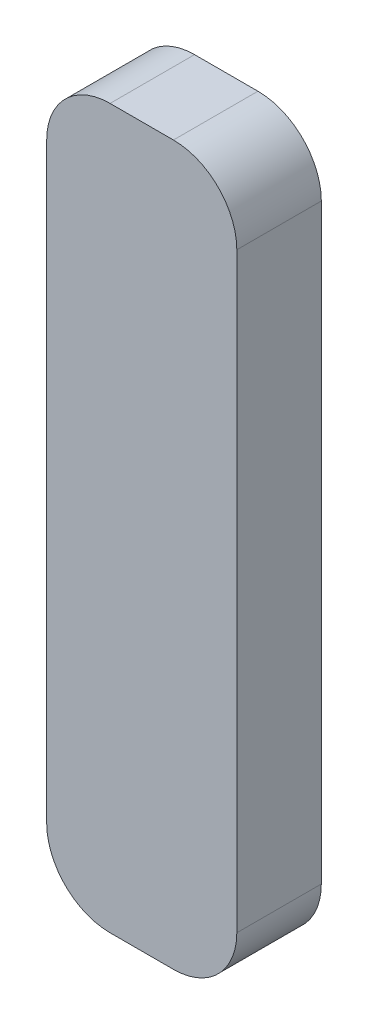
ISO-10303-21;
HEADER;
FILE_DESCRIPTION(('STEP AP214'),'2;1');
FILE_NAME('part.step','',(''),(''),'','','');
FILE_SCHEMA(('AUTOMOTIVE_DESIGN { 1 0 10303 214 1 1 1 1 }'));
ENDSEC;
DATA;
#1=APPLICATION_CONTEXT('core data for automotive mechanical design processes');
#2=APPLICATION_PROTOCOL_DEFINITION('international standard','automotive_design',2000,#1);
#3=PRODUCT_CONTEXT('',#1,'mechanical');
#4=PRODUCT('Part','Part','',(#3));
#5=PRODUCT_RELATED_PRODUCT_CATEGORY('part','',(#4));
#6=PRODUCT_DEFINITION_FORMATION('','',#4);
#7=PRODUCT_DEFINITION_CONTEXT('part definition',#1,'design');
#8=PRODUCT_DEFINITION('design','',#6,#7);
#9=PRODUCT_DEFINITION_SHAPE('','',#8);
#10=(LENGTH_UNIT() NAMED_UNIT(*) SI_UNIT(.MILLI.,.METRE.));
#11=(NAMED_UNIT(*) PLANE_ANGLE_UNIT() SI_UNIT($,.RADIAN.));
#12=(NAMED_UNIT(*) SI_UNIT($,.STERADIAN.) SOLID_ANGLE_UNIT());
#13=UNCERTAINTY_MEASURE_WITH_UNIT(LENGTH_MEASURE(1.E-05),#10,'distance_accuracy_value','');
#14=(GEOMETRIC_REPRESENTATION_CONTEXT(3) GLOBAL_UNCERTAINTY_ASSIGNED_CONTEXT((#13)) GLOBAL_UNIT_ASSIGNED_CONTEXT((#10,
#11,#12)) REPRESENTATION_CONTEXT('',''));
#15=CARTESIAN_POINT('',(0.,0.,0.));
#16=DIRECTION('',(0.,0.,1.));
#17=DIRECTION('',(1.,0.,0.));
#18=AXIS2_PLACEMENT_3D('',#15,#16,#17);
#19=CARTESIAN_POINT('',(-27.0655509183035,-46.2165040650407,4.));
#20=DIRECTION('',(1.,0.,0.));
#21=DIRECTION('',(0.,1.,0.));
#22=AXIS2_PLACEMENT_3D('',#19,#20,#21);
#23=PLANE('',#22);
#24=DIRECTION('',(0.,-1.,0.));
#25=VECTOR('',#24,1.);
#26=CARTESIAN_POINT('',(-27.0655509183035,-46.2165040650407,0.));
#27=LINE('',#26,#25);
#28=CARTESIAN_POINT('',(-27.0655509183035,-49.2165040650407,0.));
#29=VERTEX_POINT('',#28);
#30=CARTESIAN_POINT('',(-27.0655509183035,-77.2165040650407,0.));
#31=VERTEX_POINT('',#30);
#32=EDGE_CURVE('E125',#29,#31,#27,.T.);
#33=ORIENTED_EDGE('',*,*,#32,.T.);
#34=DIRECTION('',(0.,0.,-1.));
#35=VECTOR('',#34,1.);
#36=CARTESIAN_POINT('',(-27.0655509183035,-77.2165040650407,4.));
#37=LINE('',#36,#35);
#38=CARTESIAN_POINT('',(-27.0655509183035,-77.2165040650407,4.));
#39=VERTEX_POINT('',#38);
#40=EDGE_CURVE('E103',#31,#39,#37,.F.);
#41=ORIENTED_EDGE('',*,*,#40,.T.);
#42=DIRECTION('',(0.,-1.,0.));
#43=VECTOR('',#42,1.);
#44=CARTESIAN_POINT('',(-27.0655509183035,-46.2165040650407,4.));
#45=LINE('',#44,#43);
#46=CARTESIAN_POINT('',(-27.0655509183035,-49.2165040650407,4.));
#47=VERTEX_POINT('',#46);
#48=EDGE_CURVE('E134',#47,#39,#45,.T.);
#49=ORIENTED_EDGE('',*,*,#48,.F.);
#50=DIRECTION('',(0.,0.,-1.));
#51=VECTOR('',#50,1.);
#52=CARTESIAN_POINT('',(-27.0655509183035,-49.2165040650407,4.));
#53=LINE('',#52,#51);
#54=EDGE_CURVE('E108',#47,#29,#53,.T.);
#55=ORIENTED_EDGE('',*,*,#54,.T.);
#56=EDGE_LOOP('',(#33,#41,#49,#55));
#57=FACE_BOUND('',#56,.T.);
#58=ADVANCED_FACE('F33',(#57),#23,.F.);
#59=CARTESIAN_POINT('',(-27.0655509183035,-80.2165040650407,4.));
#60=DIRECTION('',(0.,1.,0.));
#61=DIRECTION('',(0.,0.,1.));
#62=AXIS2_PLACEMENT_3D('',#59,#60,#61);
#63=PLANE('',#62);
#64=DIRECTION('',(1.,0.,0.));
#65=VECTOR('',#64,1.);
#66=CARTESIAN_POINT('',(-27.0655509183035,-80.2165040650407,4.));
#67=LINE('',#66,#65);
#68=CARTESIAN_POINT('',(-24.0655509183035,-80.2165040650407,4.));
#69=VERTEX_POINT('',#68);
#70=CARTESIAN_POINT('',(-21.0655509183035,-80.2165040650407,4.));
#71=VERTEX_POINT('',#70);
#72=EDGE_CURVE('E118',#69,#71,#67,.T.);
#73=ORIENTED_EDGE('',*,*,#72,.F.);
#74=DIRECTION('',(0.,0.,-1.));
#75=VECTOR('',#74,1.);
#76=CARTESIAN_POINT('',(-24.0655509183035,-80.2165040650407,4.));
#77=LINE('',#76,#75);
#78=CARTESIAN_POINT('',(-24.0655509183035,-80.2165040650407,0.));
#79=VERTEX_POINT('',#78);
#80=EDGE_CURVE('E102',#69,#79,#77,.T.);
#81=ORIENTED_EDGE('',*,*,#80,.T.);
#82=DIRECTION('',(1.,0.,0.));
#83=VECTOR('',#82,1.);
#84=CARTESIAN_POINT('',(-27.0655509183035,-80.2165040650407,0.));
#85=LINE('',#84,#83);
#86=CARTESIAN_POINT('',(-21.0655509183035,-80.2165040650407,0.));
#87=VERTEX_POINT('',#86);
#88=EDGE_CURVE('E115',#79,#87,#85,.T.);
#89=ORIENTED_EDGE('',*,*,#88,.T.);
#90=DIRECTION('',(0.,0.,-1.));
#91=VECTOR('',#90,1.);
#92=CARTESIAN_POINT('',(-21.0655509183035,-80.2165040650407,4.));
#93=LINE('',#92,#91);
#94=EDGE_CURVE('E120',#87,#71,#93,.F.);
#95=ORIENTED_EDGE('',*,*,#94,.T.);
#96=EDGE_LOOP('',(#73,#81,#89,#95));
#97=FACE_BOUND('',#96,.T.);
#98=ADVANCED_FACE('F114',(#97),#63,.F.);
#99=CARTESIAN_POINT('',(-18.0655509183035,-46.2165040650407,4.));
#100=DIRECTION('',(-1.,0.,0.));
#101=DIRECTION('',(0.,-1.,0.));
#102=AXIS2_PLACEMENT_3D('',#99,#100,#101);
#103=PLANE('',#102);
#104=DIRECTION('',(0.,1.,0.));
#105=VECTOR('',#104,1.);
#106=CARTESIAN_POINT('',(-18.0655509183035,-46.2165040650407,4.));
#107=LINE('',#106,#105);
#108=CARTESIAN_POINT('',(-18.0655509183035,-77.2165040650407,4.));
#109=VERTEX_POINT('',#108);
#110=CARTESIAN_POINT('',(-18.0655509183035,-49.2165040650407,4.));
#111=VERTEX_POINT('',#110);
#112=EDGE_CURVE('E168',#109,#111,#107,.T.);
#113=ORIENTED_EDGE('',*,*,#112,.F.);
#114=DIRECTION('',(0.,0.,-1.));
#115=VECTOR('',#114,1.);
#116=CARTESIAN_POINT('',(-18.0655509183035,-77.2165040650407,4.));
#117=LINE('',#116,#115);
#118=CARTESIAN_POINT('',(-18.0655509183035,-77.2165040650407,0.));
#119=VERTEX_POINT('',#118);
#120=EDGE_CURVE('E153',#109,#119,#117,.T.);
#121=ORIENTED_EDGE('',*,*,#120,.T.);
#122=DIRECTION('',(0.,1.,0.));
#123=VECTOR('',#122,1.);
#124=CARTESIAN_POINT('',(-18.0655509183035,-46.2165040650407,0.));
#125=LINE('',#124,#123);
#126=CARTESIAN_POINT('',(-18.0655509183035,-49.2165040650407,0.));
#127=VERTEX_POINT('',#126);
#128=EDGE_CURVE('E124',#119,#127,#125,.T.);
#129=ORIENTED_EDGE('',*,*,#128,.T.);
#130=DIRECTION('',(0.,0.,-1.));
#131=VECTOR('',#130,1.);
#132=CARTESIAN_POINT('',(-18.0655509183035,-49.2165040650407,4.));
#133=LINE('',#132,#131);
#134=EDGE_CURVE('E151',#127,#111,#133,.F.);
#135=ORIENTED_EDGE('',*,*,#134,.T.);
#136=EDGE_LOOP('',(#113,#121,#129,#135));
#137=FACE_BOUND('',#136,.T.);
#138=ADVANCED_FACE('F179',(#137),#103,.F.);
#139=CARTESIAN_POINT('',(-27.0655509183035,-46.2165040650407,4.));
#140=DIRECTION('',(0.,-1.,0.));
#141=DIRECTION('',(0.,0.,-1.));
#142=AXIS2_PLACEMENT_3D('',#139,#140,#141);
#143=PLANE('',#142);
#144=DIRECTION('',(-1.,0.,0.));
#145=VECTOR('',#144,1.);
#146=CARTESIAN_POINT('',(-27.0655509183035,-46.2165040650407,0.));
#147=LINE('',#146,#145);
#148=CARTESIAN_POINT('',(-21.0655509183035,-46.2165040650407,0.));
#149=VERTEX_POINT('',#148);
#150=CARTESIAN_POINT('',(-24.0655509183035,-46.2165040650407,0.));
#151=VERTEX_POINT('',#150);
#152=EDGE_CURVE('E128',#149,#151,#147,.T.);
#153=ORIENTED_EDGE('',*,*,#152,.T.);
#154=DIRECTION('',(0.,0.,-1.));
#155=VECTOR('',#154,1.);
#156=CARTESIAN_POINT('',(-24.0655509183035,-46.2165040650407,4.));
#157=LINE('',#156,#155);
#158=CARTESIAN_POINT('',(-24.0655509183035,-46.2165040650407,4.));
#159=VERTEX_POINT('',#158);
#160=EDGE_CURVE('E11',#151,#159,#157,.F.);
#161=ORIENTED_EDGE('',*,*,#160,.T.);
#162=DIRECTION('',(-1.,0.,0.));
#163=VECTOR('',#162,1.);
#164=CARTESIAN_POINT('',(-27.0655509183035,-46.2165040650407,4.));
#165=LINE('',#164,#163);
#166=CARTESIAN_POINT('',(-21.0655509183035,-46.2165040650407,4.));
#167=VERTEX_POINT('',#166);
#168=EDGE_CURVE('E135',#167,#159,#165,.T.);
#169=ORIENTED_EDGE('',*,*,#168,.F.);
#170=DIRECTION('',(0.,0.,-1.));
#171=VECTOR('',#170,1.);
#172=CARTESIAN_POINT('',(-21.0655509183035,-46.2165040650407,4.));
#173=LINE('',#172,#171);
#174=EDGE_CURVE('E41',#167,#149,#173,.T.);
#175=ORIENTED_EDGE('',*,*,#174,.T.);
#176=EDGE_LOOP('',(#153,#161,#169,#175));
#177=FACE_BOUND('',#176,.T.);
#178=ADVANCED_FACE('F158',(#177),#143,.F.);
#179=CARTESIAN_POINT('',(0.,0.,4.));
#180=DIRECTION('',(0.,0.,1.));
#181=DIRECTION('',(1.,0.,0.));
#182=AXIS2_PLACEMENT_3D('',#179,#180,#181);
#183=PLANE('',#182);
#184=ORIENTED_EDGE('',*,*,#48,.T.);
#185=CARTESIAN_POINT('',(-24.0655509183035,-77.2165040650407,4.));
#186=DIRECTION('',(0.,0.,1.));
#187=DIRECTION('',(1.,0.,0.));
#188=AXIS2_PLACEMENT_3D('',#185,#186,#187);
#189=CIRCLE('',#188,3.);
#190=EDGE_CURVE('E149',#39,#69,#189,.T.);
#191=ORIENTED_EDGE('',*,*,#190,.T.);
#192=ORIENTED_EDGE('',*,*,#72,.T.);
#193=CARTESIAN_POINT('',(-21.0655509183035,-77.2165040650407,4.));
#194=DIRECTION('',(0.,0.,1.));
#195=DIRECTION('',(1.,0.,0.));
#196=AXIS2_PLACEMENT_3D('',#193,#194,#195);
#197=CIRCLE('',#196,3.);
#198=EDGE_CURVE('E147',#71,#109,#197,.T.);
#199=ORIENTED_EDGE('',*,*,#198,.T.);
#200=ORIENTED_EDGE('',*,*,#112,.T.);
#201=CARTESIAN_POINT('',(-21.0655509183035,-49.2165040650407,4.));
#202=DIRECTION('',(0.,0.,1.));
#203=DIRECTION('',(1.,0.,0.));
#204=AXIS2_PLACEMENT_3D('',#201,#202,#203);
#205=CIRCLE('',#204,3.);
#206=EDGE_CURVE('E53',#111,#167,#205,.T.);
#207=ORIENTED_EDGE('',*,*,#206,.T.);
#208=ORIENTED_EDGE('',*,*,#168,.T.);
#209=CARTESIAN_POINT('',(-24.0655509183035,-49.2165040650407,4.));
#210=DIRECTION('',(0.,0.,1.));
#211=DIRECTION('',(1.,0.,0.));
#212=AXIS2_PLACEMENT_3D('',#209,#210,#211);
#213=CIRCLE('',#212,3.);
#214=EDGE_CURVE('E145',#159,#47,#213,.T.);
#215=ORIENTED_EDGE('',*,*,#214,.T.);
#216=EDGE_LOOP('',(#184,#191,#192,#199,#200,#207,#208,#215));
#217=FACE_BOUND('',#216,.T.);
#218=ADVANCED_FACE('F171',(#217),#183,.T.);
#219=CARTESIAN_POINT('',(0.,0.,0.));
#220=DIRECTION('',(0.,0.,1.));
#221=DIRECTION('',(1.,0.,0.));
#222=AXIS2_PLACEMENT_3D('',#219,#220,#221);
#223=PLANE('',#222);
#224=ORIENTED_EDGE('',*,*,#88,.F.);
#225=CARTESIAN_POINT('',(-24.0655509183035,-77.2165040650407,0.));
#226=DIRECTION('',(0.,0.,1.));
#227=DIRECTION('',(1.,0.,0.));
#228=AXIS2_PLACEMENT_3D('',#225,#226,#227);
#229=CIRCLE('',#228,3.);
#230=EDGE_CURVE('E98',#79,#31,#229,.F.);
#231=ORIENTED_EDGE('',*,*,#230,.T.);
#232=ORIENTED_EDGE('',*,*,#32,.F.);
#233=CARTESIAN_POINT('',(-24.0655509183035,-49.2165040650407,0.));
#234=DIRECTION('',(0.,0.,1.));
#235=DIRECTION('',(1.,0.,0.));
#236=AXIS2_PLACEMENT_3D('',#233,#234,#235);
#237=CIRCLE('',#236,3.);
#238=EDGE_CURVE('E138',#29,#151,#237,.F.);
#239=ORIENTED_EDGE('',*,*,#238,.T.);
#240=ORIENTED_EDGE('',*,*,#152,.F.);
#241=CARTESIAN_POINT('',(-21.0655509183035,-49.2165040650407,0.));
#242=DIRECTION('',(0.,0.,1.));
#243=DIRECTION('',(1.,0.,0.));
#244=AXIS2_PLACEMENT_3D('',#241,#242,#243);
#245=CIRCLE('',#244,3.);
#246=EDGE_CURVE('E119',#149,#127,#245,.F.);
#247=ORIENTED_EDGE('',*,*,#246,.T.);
#248=ORIENTED_EDGE('',*,*,#128,.F.);
#249=CARTESIAN_POINT('',(-21.0655509183035,-77.2165040650407,0.));
#250=DIRECTION('',(0.,0.,1.));
#251=DIRECTION('',(1.,0.,0.));
#252=AXIS2_PLACEMENT_3D('',#249,#250,#251);
#253=CIRCLE('',#252,3.);
#254=EDGE_CURVE('E109',#119,#87,#253,.F.);
#255=ORIENTED_EDGE('',*,*,#254,.T.);
#256=EDGE_LOOP('',(#224,#231,#232,#239,#240,#247,#248,#255));
#257=FACE_BOUND('',#256,.T.);
#258=ADVANCED_FACE('F122',(#257),#223,.F.);
#259=CARTESIAN_POINT('',(-24.0655509183035,-77.2165040650407,4.));
#260=DIRECTION('',(0.,0.,-1.));
#261=DIRECTION('',(-1.,0.,0.));
#262=AXIS2_PLACEMENT_3D('',#259,#260,#261);
#263=CYLINDRICAL_SURFACE('',#262,3.);
#264=ORIENTED_EDGE('',*,*,#190,.F.);
#265=ORIENTED_EDGE('',*,*,#40,.F.);
#266=ORIENTED_EDGE('',*,*,#230,.F.);
#267=ORIENTED_EDGE('',*,*,#80,.F.);
#268=EDGE_LOOP('',(#264,#265,#266,#267));
#269=FACE_BOUND('',#268,.T.);
#270=ADVANCED_FACE('F101',(#269),#263,.T.);
#271=CARTESIAN_POINT('',(-21.0655509183035,-77.2165040650407,4.));
#272=DIRECTION('',(0.,0.,-1.));
#273=DIRECTION('',(-1.,0.,0.));
#274=AXIS2_PLACEMENT_3D('',#271,#272,#273);
#275=CYLINDRICAL_SURFACE('',#274,3.);
#276=ORIENTED_EDGE('',*,*,#198,.F.);
#277=ORIENTED_EDGE('',*,*,#94,.F.);
#278=ORIENTED_EDGE('',*,*,#254,.F.);
#279=ORIENTED_EDGE('',*,*,#120,.F.);
#280=EDGE_LOOP('',(#276,#277,#278,#279));
#281=FACE_BOUND('',#280,.T.);
#282=ADVANCED_FACE('F191',(#281),#275,.T.);
#283=CARTESIAN_POINT('',(-24.0655509183035,-49.2165040650407,4.));
#284=DIRECTION('',(0.,0.,-1.));
#285=DIRECTION('',(-1.,0.,0.));
#286=AXIS2_PLACEMENT_3D('',#283,#284,#285);
#287=CYLINDRICAL_SURFACE('',#286,3.);
#288=ORIENTED_EDGE('',*,*,#214,.F.);
#289=ORIENTED_EDGE('',*,*,#160,.F.);
#290=ORIENTED_EDGE('',*,*,#238,.F.);
#291=ORIENTED_EDGE('',*,*,#54,.F.);
#292=EDGE_LOOP('',(#288,#289,#290,#291));
#293=FACE_BOUND('',#292,.T.);
#294=ADVANCED_FACE('F163',(#293),#287,.T.);
#295=CARTESIAN_POINT('',(-21.0655509183035,-49.2165040650407,4.));
#296=DIRECTION('',(0.,0.,-1.));
#297=DIRECTION('',(-1.,0.,0.));
#298=AXIS2_PLACEMENT_3D('',#295,#296,#297);
#299=CYLINDRICAL_SURFACE('',#298,3.);
#300=ORIENTED_EDGE('',*,*,#206,.F.);
#301=ORIENTED_EDGE('',*,*,#134,.F.);
#302=ORIENTED_EDGE('',*,*,#246,.F.);
#303=ORIENTED_EDGE('',*,*,#174,.F.);
#304=EDGE_LOOP('',(#300,#301,#302,#303));
#305=FACE_BOUND('',#304,.T.);
#306=ADVANCED_FACE('F35',(#305),#299,.T.);
#307=CLOSED_SHELL('',(#58,#98,#138,#178,#218,#258,#270,#282,#294,#306));
#308=MANIFOLD_SOLID_BREP('B2',#307);
#309=ADVANCED_BREP_SHAPE_REPRESENTATION('',(#18,#308),#14);
#310=SHAPE_DEFINITION_REPRESENTATION(#9,#309);
ENDSEC;
END-ISO-10303-21;
